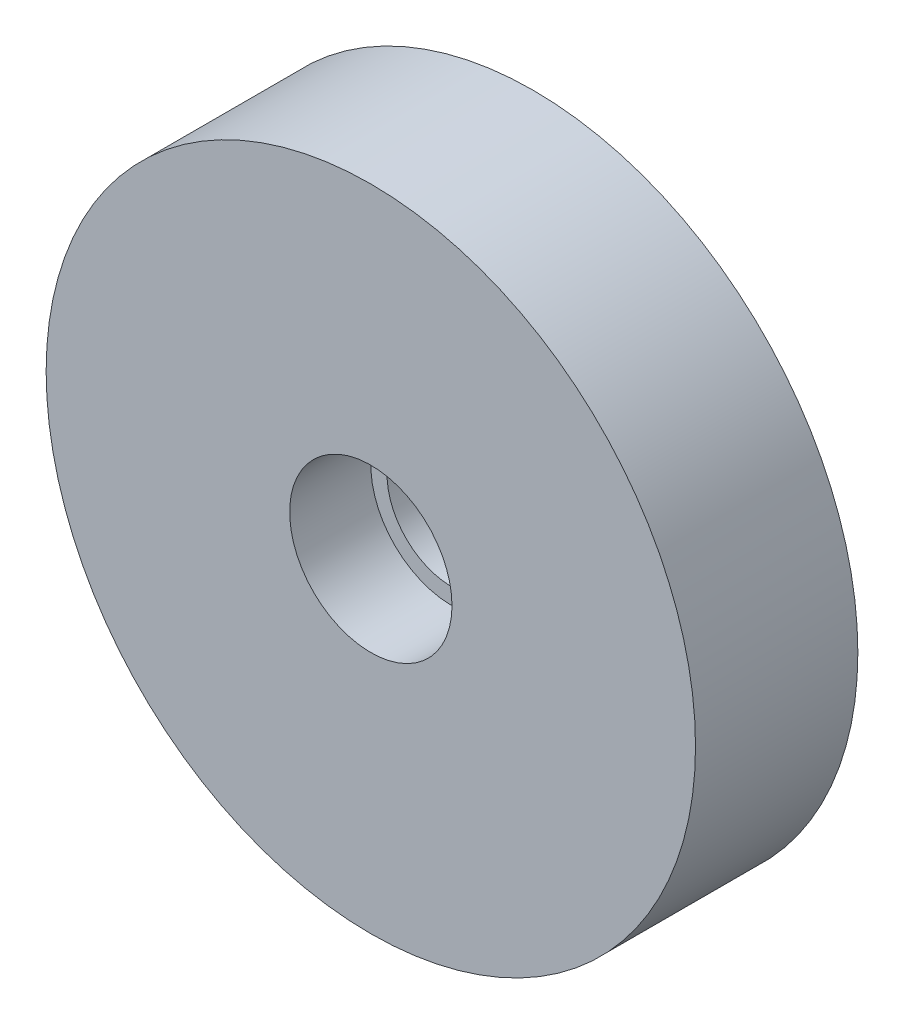
ISO-10303-21;
HEADER;
FILE_DESCRIPTION(('STEP AP214'),'2;1');
FILE_NAME('part.step','',(''),(''),'','','');
FILE_SCHEMA(('AUTOMOTIVE_DESIGN { 1 0 10303 214 1 1 1 1 }'));
ENDSEC;
DATA;
#1=APPLICATION_CONTEXT('core data for automotive mechanical design processes');
#2=APPLICATION_PROTOCOL_DEFINITION('international standard','automotive_design',2000,#1);
#3=PRODUCT_CONTEXT('',#1,'mechanical');
#4=PRODUCT('Part','Part','',(#3));
#5=PRODUCT_RELATED_PRODUCT_CATEGORY('part','',(#4));
#6=PRODUCT_DEFINITION_FORMATION('','',#4);
#7=PRODUCT_DEFINITION_CONTEXT('part definition',#1,'design');
#8=PRODUCT_DEFINITION('design','',#6,#7);
#9=PRODUCT_DEFINITION_SHAPE('','',#8);
#10=(LENGTH_UNIT() NAMED_UNIT(*) SI_UNIT(.MILLI.,.METRE.));
#11=(NAMED_UNIT(*) PLANE_ANGLE_UNIT() SI_UNIT($,.RADIAN.));
#12=(NAMED_UNIT(*) SI_UNIT($,.STERADIAN.) SOLID_ANGLE_UNIT());
#13=UNCERTAINTY_MEASURE_WITH_UNIT(LENGTH_MEASURE(1.E-05),#10,'distance_accuracy_value','');
#14=(GEOMETRIC_REPRESENTATION_CONTEXT(3) GLOBAL_UNCERTAINTY_ASSIGNED_CONTEXT((#13)) GLOBAL_UNIT_ASSIGNED_CONTEXT((#10,
#11,#12)) REPRESENTATION_CONTEXT('',''));
#15=CARTESIAN_POINT('',(0.,0.,0.));
#16=DIRECTION('',(0.,0.,1.));
#17=DIRECTION('',(1.,0.,0.));
#18=AXIS2_PLACEMENT_3D('',#15,#16,#17);
#19=CARTESIAN_POINT('',(1.28563826251593E-10,280.,0.));
#20=DIRECTION('',(0.,0.,1.));
#21=DIRECTION('',(1.,0.,0.));
#22=AXIS2_PLACEMENT_3D('',#19,#20,#21);
#23=PLANE('',#22);
#24=CARTESIAN_POINT('',(1.28563826251593E-10,280.,0.));
#25=DIRECTION('',(0.,0.,1.));
#26=DIRECTION('',(1.,0.,0.));
#27=AXIS2_PLACEMENT_3D('',#24,#25,#26);
#28=CIRCLE('',#27,20.);
#29=CARTESIAN_POINT('',(20.0000000001285,280.,0.));
#30=VERTEX_POINT('',#29);
#31=EDGE_CURVE('E42',#30,#30,#28,.T.);
#32=ORIENTED_EDGE('',*,*,#31,.F.);
#33=EDGE_LOOP('',(#32));
#34=FACE_BOUND('',#33,.T.);
#35=CARTESIAN_POINT('',(1.2756462552943E-10,280.,0.));
#36=DIRECTION('',(0.,0.,1.));
#37=DIRECTION('',(1.,0.,0.));
#38=AXIS2_PLACEMENT_3D('',#35,#36,#37);
#39=CIRCLE('',#38,12.);
#40=CARTESIAN_POINT('',(12.0000000001276,280.,0.));
#41=VERTEX_POINT('',#40);
#42=EDGE_CURVE('E10',#41,#41,#39,.F.);
#43=ORIENTED_EDGE('',*,*,#42,.F.);
#44=EDGE_LOOP('',(#43));
#45=FACE_BOUND('',#44,.T.);
#46=ADVANCED_FACE('F31',(#34,#45),#23,.F.);
#47=CARTESIAN_POINT('',(1.28563826251593E-10,280.,0.));
#48=DIRECTION('',(0.,0.,1.));
#49=DIRECTION('',(1.,0.,0.));
#50=AXIS2_PLACEMENT_3D('',#47,#48,#49);
#51=CYLINDRICAL_SURFACE('',#50,3.99999999999999);
#52=CARTESIAN_POINT('',(1.28563826251593E-10,280.,5.));
#53=DIRECTION('',(0.,0.,1.));
#54=DIRECTION('',(1.,0.,0.));
#55=AXIS2_PLACEMENT_3D('',#52,#53,#54);
#56=CIRCLE('',#55,3.99999999999999);
#57=CARTESIAN_POINT('',(4.00000000012856,280.,5.));
#58=VERTEX_POINT('',#57);
#59=EDGE_CURVE('E47',#58,#58,#56,.F.);
#60=ORIENTED_EDGE('',*,*,#59,.F.);
#61=EDGE_LOOP('',(#60));
#62=FACE_BOUND('',#61,.T.);
#63=CARTESIAN_POINT('',(1.28563826251593E-10,280.,-5.));
#64=DIRECTION('',(0.,0.,-1.));
#65=DIRECTION('',(-1.,0.,0.));
#66=AXIS2_PLACEMENT_3D('',#63,#64,#65);
#67=CIRCLE('',#66,3.99999999999999);
#68=CARTESIAN_POINT('',(-3.99999999987143,280.,-5.));
#69=VERTEX_POINT('',#68);
#70=EDGE_CURVE('E64',#69,#69,#67,.T.);
#71=ORIENTED_EDGE('',*,*,#70,.T.);
#72=EDGE_LOOP('',(#71));
#73=FACE_BOUND('',#72,.T.);
#74=ADVANCED_FACE('F68',(#62,#73),#51,.F.);
#75=CARTESIAN_POINT('',(1.28563826251593E-10,280.,10.));
#76=DIRECTION('',(0.,0.,-1.));
#77=DIRECTION('',(-1.,0.,0.));
#78=AXIS2_PLACEMENT_3D('',#75,#76,#77);
#79=CYLINDRICAL_SURFACE('',#78,20.);
#80=CARTESIAN_POINT('',(1.28563826251593E-10,280.,10.));
#81=DIRECTION('',(0.,0.,1.));
#82=DIRECTION('',(1.,0.,0.));
#83=AXIS2_PLACEMENT_3D('',#80,#81,#82);
#84=CIRCLE('',#83,20.);
#85=CARTESIAN_POINT('',(20.0000000001285,280.,10.));
#86=VERTEX_POINT('',#85);
#87=EDGE_CURVE('E38',#86,#86,#84,.T.);
#88=ORIENTED_EDGE('',*,*,#87,.F.);
#89=EDGE_LOOP('',(#88));
#90=FACE_BOUND('',#89,.T.);
#91=ORIENTED_EDGE('',*,*,#31,.T.);
#92=EDGE_LOOP('',(#91));
#93=FACE_BOUND('',#92,.T.);
#94=ADVANCED_FACE('F33',(#90,#93),#79,.T.);
#95=CARTESIAN_POINT('',(1.28563826251593E-10,280.,10.));
#96=DIRECTION('',(0.,0.,1.));
#97=DIRECTION('',(1.,0.,0.));
#98=AXIS2_PLACEMENT_3D('',#95,#96,#97);
#99=PLANE('',#98);
#100=CARTESIAN_POINT('',(1.2756462552943E-10,280.,10.));
#101=DIRECTION('',(0.,0.,1.));
#102=DIRECTION('',(1.,0.,0.));
#103=AXIS2_PLACEMENT_3D('',#100,#101,#102);
#104=CIRCLE('',#103,5.00000000000004);
#105=CARTESIAN_POINT('',(5.00000000012761,280.,10.));
#106=VERTEX_POINT('',#105);
#107=EDGE_CURVE('E50',#106,#106,#104,.T.);
#108=ORIENTED_EDGE('',*,*,#107,.F.);
#109=EDGE_LOOP('',(#108));
#110=FACE_BOUND('',#109,.T.);
#111=ORIENTED_EDGE('',*,*,#87,.T.);
#112=EDGE_LOOP('',(#111));
#113=FACE_BOUND('',#112,.T.);
#114=ADVANCED_FACE('F93',(#110,#113),#99,.T.);
#115=CARTESIAN_POINT('',(1.2756462552943E-10,280.,5.));
#116=DIRECTION('',(0.,0.,1.));
#117=DIRECTION('',(1.,0.,0.));
#118=AXIS2_PLACEMENT_3D('',#115,#116,#117);
#119=PLANE('',#118);
#120=CARTESIAN_POINT('',(1.2756462552943E-10,280.,5.));
#121=DIRECTION('',(0.,0.,1.));
#122=DIRECTION('',(1.,0.,0.));
#123=AXIS2_PLACEMENT_3D('',#120,#121,#122);
#124=CIRCLE('',#123,5.00000000000004);
#125=CARTESIAN_POINT('',(5.00000000012761,280.,5.));
#126=VERTEX_POINT('',#125);
#127=EDGE_CURVE('E53',#126,#126,#124,.T.);
#128=ORIENTED_EDGE('',*,*,#127,.T.);
#129=EDGE_LOOP('',(#128));
#130=FACE_BOUND('',#129,.T.);
#131=ORIENTED_EDGE('',*,*,#59,.T.);
#132=EDGE_LOOP('',(#131));
#133=FACE_BOUND('',#132,.T.);
#134=ADVANCED_FACE('F95',(#130,#133),#119,.T.);
#135=CARTESIAN_POINT('',(1.2756462552943E-10,280.,5.));
#136=DIRECTION('',(0.,0.,1.));
#137=DIRECTION('',(1.,0.,0.));
#138=AXIS2_PLACEMENT_3D('',#135,#136,#137);
#139=CYLINDRICAL_SURFACE('',#138,5.00000000000004);
#140=ORIENTED_EDGE('',*,*,#127,.F.);
#141=EDGE_LOOP('',(#140));
#142=FACE_BOUND('',#141,.T.);
#143=ORIENTED_EDGE('',*,*,#107,.T.);
#144=EDGE_LOOP('',(#143));
#145=FACE_BOUND('',#144,.T.);
#146=ADVANCED_FACE('F74',(#142,#145),#139,.F.);
#147=CARTESIAN_POINT('',(1.2756462552943E-10,280.,-5.));
#148=DIRECTION('',(0.,0.,-1.));
#149=DIRECTION('',(-1.,0.,0.));
#150=AXIS2_PLACEMENT_3D('',#147,#148,#149);
#151=PLANE('',#150);
#152=ORIENTED_EDGE('',*,*,#70,.F.);
#153=EDGE_LOOP('',(#152));
#154=FACE_BOUND('',#153,.T.);
#155=CARTESIAN_POINT('',(1.2756462552943E-10,280.,-5.));
#156=DIRECTION('',(0.,0.,-1.));
#157=DIRECTION('',(-1.,0.,0.));
#158=AXIS2_PLACEMENT_3D('',#155,#156,#157);
#159=CIRCLE('',#158,12.);
#160=CARTESIAN_POINT('',(-11.9999999998725,280.,-5.));
#161=VERTEX_POINT('',#160);
#162=EDGE_CURVE('E60',#161,#161,#159,.T.);
#163=ORIENTED_EDGE('',*,*,#162,.T.);
#164=EDGE_LOOP('',(#163));
#165=FACE_BOUND('',#164,.T.);
#166=ADVANCED_FACE('F70',(#154,#165),#151,.T.);
#167=CARTESIAN_POINT('',(1.2756462552943E-10,280.,-5.));
#168=DIRECTION('',(0.,0.,1.));
#169=DIRECTION('',(1.,0.,0.));
#170=AXIS2_PLACEMENT_3D('',#167,#168,#169);
#171=CYLINDRICAL_SURFACE('',#170,12.);
#172=ORIENTED_EDGE('',*,*,#162,.F.);
#173=EDGE_LOOP('',(#172));
#174=FACE_BOUND('',#173,.T.);
#175=ORIENTED_EDGE('',*,*,#42,.T.);
#176=EDGE_LOOP('',(#175));
#177=FACE_BOUND('',#176,.T.);
#178=ADVANCED_FACE('F73',(#174,#177),#171,.T.);
#179=CLOSED_SHELL('',(#46,#74,#94,#114,#134,#146,#166,#178));
#180=MANIFOLD_SOLID_BREP('B2',#179);
#181=ADVANCED_BREP_SHAPE_REPRESENTATION('',(#18,#180),#14);
#182=SHAPE_DEFINITION_REPRESENTATION(#9,#181);
ENDSEC;
END-ISO-10303-21;
